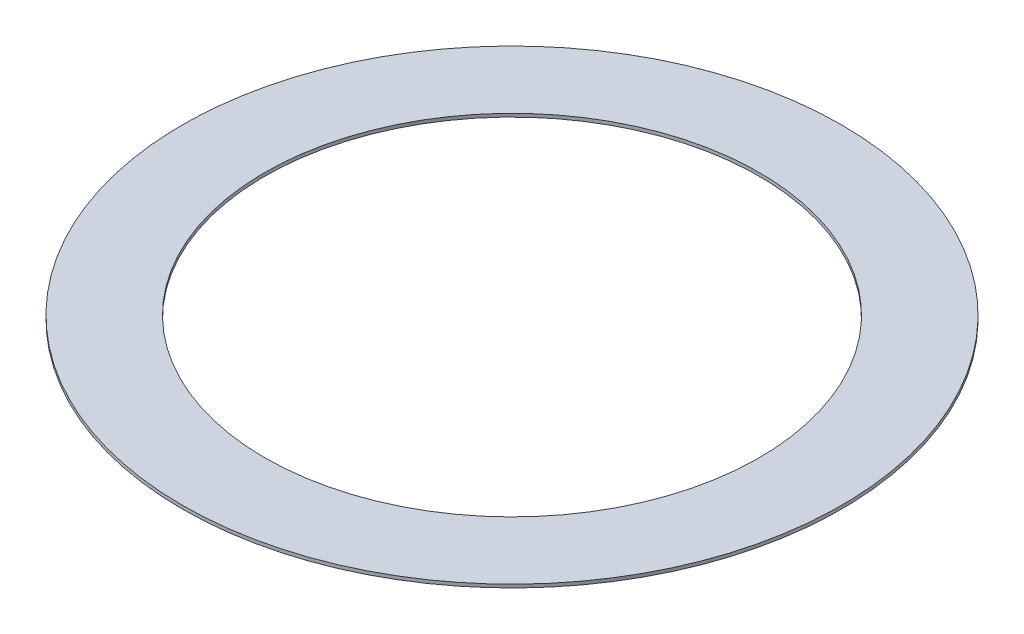
ISO-10303-21;
HEADER;
FILE_DESCRIPTION(('STEP AP214'),'2;1');
FILE_NAME('part.step','',(''),(''),'','','');
FILE_SCHEMA(('AUTOMOTIVE_DESIGN { 1 0 10303 214 1 1 1 1 }'));
ENDSEC;
DATA;
#1=APPLICATION_CONTEXT('core data for automotive mechanical design processes');
#2=APPLICATION_PROTOCOL_DEFINITION('international standard','automotive_design',2000,#1);
#3=PRODUCT_CONTEXT('',#1,'mechanical');
#4=PRODUCT('Part','Part','',(#3));
#5=PRODUCT_RELATED_PRODUCT_CATEGORY('part','',(#4));
#6=PRODUCT_DEFINITION_FORMATION('','',#4);
#7=PRODUCT_DEFINITION_CONTEXT('part definition',#1,'design');
#8=PRODUCT_DEFINITION('design','',#6,#7);
#9=PRODUCT_DEFINITION_SHAPE('','',#8);
#10=(LENGTH_UNIT() NAMED_UNIT(*) SI_UNIT(.MILLI.,.METRE.));
#11=(NAMED_UNIT(*) PLANE_ANGLE_UNIT() SI_UNIT($,.RADIAN.));
#12=(NAMED_UNIT(*) SI_UNIT($,.STERADIAN.) SOLID_ANGLE_UNIT());
#13=UNCERTAINTY_MEASURE_WITH_UNIT(LENGTH_MEASURE(1.E-05),#10,'distance_accuracy_value','');
#14=(GEOMETRIC_REPRESENTATION_CONTEXT(3) GLOBAL_UNCERTAINTY_ASSIGNED_CONTEXT((#13)) GLOBAL_UNIT_ASSIGNED_CONTEXT((#10,
#11,#12)) REPRESENTATION_CONTEXT('',''));
#15=CARTESIAN_POINT('',(0.,0.,0.));
#16=DIRECTION('',(0.,0.,1.));
#17=DIRECTION('',(1.,0.,0.));
#18=AXIS2_PLACEMENT_3D('',#15,#16,#17);
#19=CARTESIAN_POINT('',(0.,55.,0.));
#20=DIRECTION('',(0.,1.,0.));
#21=DIRECTION('',(0.,0.,1.));
#22=AXIS2_PLACEMENT_3D('',#19,#20,#21);
#23=CYLINDRICAL_SURFACE('',#22,9.525);
#24=CARTESIAN_POINT('',(0.,-0.127000000000002,0.));
#25=DIRECTION('',(0.,1.,0.));
#26=DIRECTION('',(0.,0.,1.));
#27=AXIS2_PLACEMENT_3D('',#24,#25,#26);
#28=CIRCLE('',#27,9.525);
#29=CARTESIAN_POINT('',(0.,-0.127000000000002,9.525));
#30=VERTEX_POINT('',#29);
#31=EDGE_CURVE('E10',#30,#30,#28,.T.);
#32=ORIENTED_EDGE('',*,*,#31,.F.);
#33=EDGE_LOOP('',(#32));
#34=FACE_BOUND('',#33,.T.);
#35=CARTESIAN_POINT('',(0.,0.,0.));
#36=DIRECTION('',(0.,1.,0.));
#37=DIRECTION('',(0.,0.,1.));
#38=AXIS2_PLACEMENT_3D('',#35,#36,#37);
#39=CIRCLE('',#38,9.525);
#40=CARTESIAN_POINT('',(0.,0.,9.525));
#41=VERTEX_POINT('',#40);
#42=EDGE_CURVE('E46',#41,#41,#39,.T.);
#43=ORIENTED_EDGE('',*,*,#42,.T.);
#44=EDGE_LOOP('',(#43));
#45=FACE_BOUND('',#44,.T.);
#46=ADVANCED_FACE('F32',(#34,#45),#23,.F.);
#47=CARTESIAN_POINT('',(-9.525,-0.127,0.));
#48=DIRECTION('',(0.,1.,0.));
#49=DIRECTION('',(0.,0.,1.));
#50=AXIS2_PLACEMENT_3D('',#47,#48,#49);
#51=PLANE('',#50);
#52=CARTESIAN_POINT('',(0.,-0.127000000000002,0.));
#53=DIRECTION('',(0.,1.,0.));
#54=DIRECTION('',(0.,0.,1.));
#55=AXIS2_PLACEMENT_3D('',#52,#53,#54);
#56=CIRCLE('',#55,12.7);
#57=CARTESIAN_POINT('',(0.,-0.127000000000002,12.7));
#58=VERTEX_POINT('',#57);
#59=EDGE_CURVE('E38',#58,#58,#56,.T.);
#60=ORIENTED_EDGE('',*,*,#59,.F.);
#61=EDGE_LOOP('',(#60));
#62=FACE_BOUND('',#61,.T.);
#63=ORIENTED_EDGE('',*,*,#31,.T.);
#64=EDGE_LOOP('',(#63));
#65=FACE_BOUND('',#64,.T.);
#66=ADVANCED_FACE('F61',(#62,#65),#51,.F.);
#67=CARTESIAN_POINT('',(0.,55.,0.));
#68=DIRECTION('',(0.,1.,0.));
#69=DIRECTION('',(0.,0.,1.));
#70=AXIS2_PLACEMENT_3D('',#67,#68,#69);
#71=CYLINDRICAL_SURFACE('',#70,12.7);
#72=CARTESIAN_POINT('',(0.,0.,0.));
#73=DIRECTION('',(0.,1.,0.));
#74=DIRECTION('',(0.,0.,1.));
#75=AXIS2_PLACEMENT_3D('',#72,#73,#74);
#76=CIRCLE('',#75,12.7);
#77=CARTESIAN_POINT('',(0.,0.,12.7));
#78=VERTEX_POINT('',#77);
#79=EDGE_CURVE('E42',#78,#78,#76,.T.);
#80=ORIENTED_EDGE('',*,*,#79,.F.);
#81=EDGE_LOOP('',(#80));
#82=FACE_BOUND('',#81,.T.);
#83=ORIENTED_EDGE('',*,*,#59,.T.);
#84=EDGE_LOOP('',(#83));
#85=FACE_BOUND('',#84,.T.);
#86=ADVANCED_FACE('F56',(#82,#85),#71,.T.);
#87=CARTESIAN_POINT('',(-9.525,0.,0.));
#88=DIRECTION('',(0.,-1.,0.));
#89=DIRECTION('',(0.,0.,-1.));
#90=AXIS2_PLACEMENT_3D('',#87,#88,#89);
#91=PLANE('',#90);
#92=ORIENTED_EDGE('',*,*,#42,.F.);
#93=EDGE_LOOP('',(#92));
#94=FACE_BOUND('',#93,.T.);
#95=ORIENTED_EDGE('',*,*,#79,.T.);
#96=EDGE_LOOP('',(#95));
#97=FACE_BOUND('',#96,.T.);
#98=ADVANCED_FACE('F53',(#94,#97),#91,.F.);
#99=CLOSED_SHELL('',(#46,#66,#86,#98));
#100=MANIFOLD_SOLID_BREP('B2',#99);
#101=ADVANCED_BREP_SHAPE_REPRESENTATION('',(#18,#100),#14);
#102=SHAPE_DEFINITION_REPRESENTATION(#9,#101);
ENDSEC;
END-ISO-10303-21;
